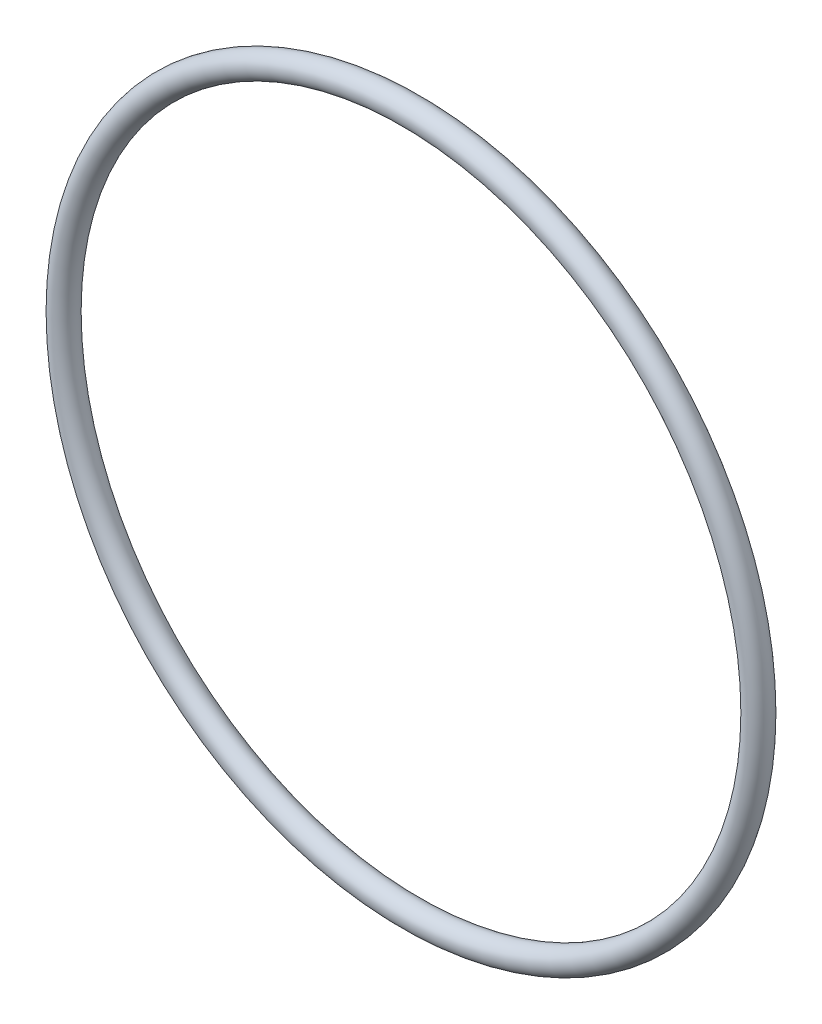
ISO-10303-21;
HEADER;
FILE_DESCRIPTION(('STEP AP214'),'2;1');
FILE_NAME('part.step','',(''),(''),'','','');
FILE_SCHEMA(('AUTOMOTIVE_DESIGN { 1 0 10303 214 1 1 1 1 }'));
ENDSEC;
DATA;
#1=APPLICATION_CONTEXT('core data for automotive mechanical design processes');
#2=APPLICATION_PROTOCOL_DEFINITION('international standard','automotive_design',2000,#1);
#3=PRODUCT_CONTEXT('',#1,'mechanical');
#4=PRODUCT('Part','Part','',(#3));
#5=PRODUCT_RELATED_PRODUCT_CATEGORY('part','',(#4));
#6=PRODUCT_DEFINITION_FORMATION('','',#4);
#7=PRODUCT_DEFINITION_CONTEXT('part definition',#1,'design');
#8=PRODUCT_DEFINITION('design','',#6,#7);
#9=PRODUCT_DEFINITION_SHAPE('','',#8);
#10=(LENGTH_UNIT() NAMED_UNIT(*) SI_UNIT(.MILLI.,.METRE.));
#11=(NAMED_UNIT(*) PLANE_ANGLE_UNIT() SI_UNIT($,.RADIAN.));
#12=(NAMED_UNIT(*) SI_UNIT($,.STERADIAN.) SOLID_ANGLE_UNIT());
#13=UNCERTAINTY_MEASURE_WITH_UNIT(LENGTH_MEASURE(1.E-05),#10,'distance_accuracy_value','');
#14=(GEOMETRIC_REPRESENTATION_CONTEXT(3) GLOBAL_UNCERTAINTY_ASSIGNED_CONTEXT((#13)) GLOBAL_UNIT_ASSIGNED_CONTEXT((#10,
#11,#12)) REPRESENTATION_CONTEXT('',''));
#15=CARTESIAN_POINT('',(0.,0.,0.));
#16=DIRECTION('',(0.,0.,1.));
#17=DIRECTION('',(1.,0.,0.));
#18=AXIS2_PLACEMENT_3D('',#15,#16,#17);
#19=CARTESIAN_POINT('',(0.,0.,1.9));
#20=DIRECTION('',(0.,0.,-1.));
#21=DIRECTION('',(-1.,0.,0.));
#22=AXIS2_PLACEMENT_3D('',#19,#20,#21);
#23=TOROIDAL_SURFACE('',#22,1.4,0.0499999999999999);
#24=CARTESIAN_POINT('',(-1.45,0.,1.9));
#25=VERTEX_POINT('',#24);
#26=VERTEX_LOOP('',#25);
#27=FACE_BOUND('',#26,.T.);
#28=ADVANCED_FACE('F13',(#27),#23,.T.);
#29=CLOSED_SHELL('',(#28));
#30=MANIFOLD_SOLID_BREP('B1',#29);
#31=ADVANCED_BREP_SHAPE_REPRESENTATION('',(#18,#30),#14);
#32=SHAPE_DEFINITION_REPRESENTATION(#9,#31);
ENDSEC;
END-ISO-10303-21;
